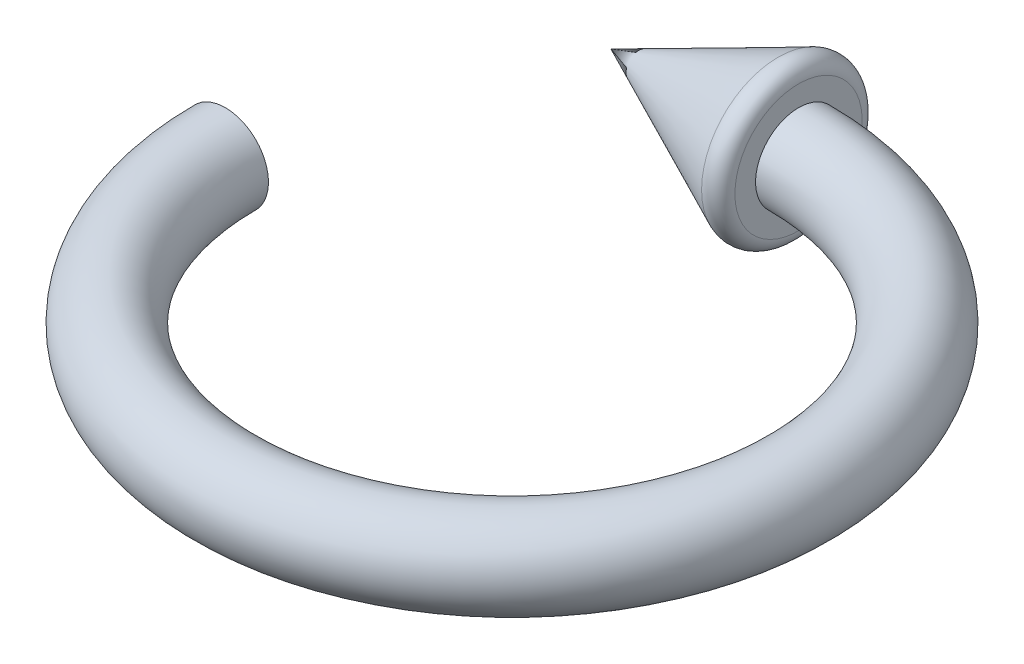
ISO-10303-21;
HEADER;
FILE_DESCRIPTION(('STEP AP214'),'2;1');
FILE_NAME('part.step','',(''),(''),'','','');
FILE_SCHEMA(('AUTOMOTIVE_DESIGN { 1 0 10303 214 1 1 1 1 }'));
ENDSEC;
DATA;
#1=APPLICATION_CONTEXT('core data for automotive mechanical design processes');
#2=APPLICATION_PROTOCOL_DEFINITION('international standard','automotive_design',2000,#1);
#3=PRODUCT_CONTEXT('',#1,'mechanical');
#4=PRODUCT('Part','Part','',(#3));
#5=PRODUCT_RELATED_PRODUCT_CATEGORY('part','',(#4));
#6=PRODUCT_DEFINITION_FORMATION('','',#4);
#7=PRODUCT_DEFINITION_CONTEXT('part definition',#1,'design');
#8=PRODUCT_DEFINITION('design','',#6,#7);
#9=PRODUCT_DEFINITION_SHAPE('','',#8);
#10=(LENGTH_UNIT() NAMED_UNIT(*) SI_UNIT(.MILLI.,.METRE.));
#11=(NAMED_UNIT(*) PLANE_ANGLE_UNIT() SI_UNIT($,.RADIAN.));
#12=(NAMED_UNIT(*) SI_UNIT($,.STERADIAN.) SOLID_ANGLE_UNIT());
#13=UNCERTAINTY_MEASURE_WITH_UNIT(LENGTH_MEASURE(1.E-05),#10,'distance_accuracy_value','');
#14=(GEOMETRIC_REPRESENTATION_CONTEXT(3) GLOBAL_UNCERTAINTY_ASSIGNED_CONTEXT((#13)) GLOBAL_UNIT_ASSIGNED_CONTEXT((#10,
#11,#12)) REPRESENTATION_CONTEXT('',''));
#15=CARTESIAN_POINT('',(0.,0.,0.));
#16=DIRECTION('',(0.,0.,1.));
#17=DIRECTION('',(1.,0.,0.));
#18=AXIS2_PLACEMENT_3D('',#15,#16,#17);
#19=CARTESIAN_POINT('',(0.,0.,0.));
#20=DIRECTION('',(0.,-1.,0.));
#21=DIRECTION('',(0.,0.,-1.));
#22=AXIS2_PLACEMENT_3D('',#19,#20,#21);
#23=TOROIDAL_SURFACE('',#22,200.,30.);
#24=CARTESIAN_POINT('',(-2.80543275242573E-12,0.,-200.));
#25=DIRECTION('',(-1.,0.,0.));
#26=DIRECTION('',(0.,0.,1.));
#27=AXIS2_PLACEMENT_3D('',#24,#25,#26);
#28=CIRCLE('',#27,30.);
#29=CARTESIAN_POINT('',(-3.22624766528959E-12,0.,-230.));
#30=VERTEX_POINT('',#29);
#31=EDGE_CURVE('E65',#30,#30,#28,.T.);
#32=CARTESIAN_POINT('',(-200.,0.,0.));
#33=DIRECTION('',(0.,0.,1.));
#34=DIRECTION('',(1.,0.,0.));
#35=AXIS2_PLACEMENT_3D('',#32,#33,#34);
#36=CIRCLE('',#35,30.);
#37=CARTESIAN_POINT('',(-230.,0.,0.));
#38=VERTEX_POINT('',#37);
#39=EDGE_CURVE('E68',#38,#38,#36,.T.);
#40=CARTESIAN_POINT('',(0.,0.,0.));
#41=DIRECTION('',(0.,-1.,0.));
#42=DIRECTION('',(0.,0.,-1.));
#43=AXIS2_PLACEMENT_3D('',#40,#41,#42);
#44=CIRCLE('',#43,230.);
#45=EDGE_CURVE('',#30,#38,#44,.T.);
#46=ORIENTED_EDGE('',*,*,#31,.F.);
#47=ORIENTED_EDGE('',*,*,#39,.T.);
#48=ORIENTED_EDGE('',*,*,#45,.T.);
#49=ORIENTED_EDGE('',*,*,#45,.F.);
#50=EDGE_LOOP('',(#46,#48,#47,#49));
#51=FACE_BOUND('',#50,.T.);
#52=ADVANCED_FACE('F31',(#51),#23,.T.);
#53=CARTESIAN_POINT('',(-200.,0.,0.));
#54=DIRECTION('',(0.,0.,1.));
#55=DIRECTION('',(1.,0.,0.));
#56=AXIS2_PLACEMENT_3D('',#53,#54,#55);
#57=PLANE('',#56);
#58=ORIENTED_EDGE('',*,*,#39,.F.);
#59=EDGE_LOOP('',(#58));
#60=FACE_BOUND('',#59,.T.);
#61=ADVANCED_FACE('F51',(#60),#57,.F.);
#62=CARTESIAN_POINT('',(0.,0.,-200.));
#63=DIRECTION('',(-1.,0.,0.));
#64=DIRECTION('',(0.,0.,1.));
#65=AXIS2_PLACEMENT_3D('',#62,#63,#64);
#66=PLANE('',#65);
#67=CARTESIAN_POINT('',(0.,0.,-200.));
#68=DIRECTION('',(-1.,0.,0.));
#69=DIRECTION('',(0.,0.,1.));
#70=AXIS2_PLACEMENT_3D('',#67,#68,#69);
#71=CIRCLE('',#70,44.4193415805561);
#72=CARTESIAN_POINT('',(0.,0.,-155.580658419444));
#73=VERTEX_POINT('',#72);
#74=EDGE_CURVE('E11',#73,#73,#71,.F.);
#75=ORIENTED_EDGE('',*,*,#74,.T.);
#76=EDGE_LOOP('',(#75));
#77=FACE_BOUND('',#76,.T.);
#78=ORIENTED_EDGE('',*,*,#31,.T.);
#79=EDGE_LOOP('',(#78));
#80=FACE_BOUND('',#79,.T.);
#81=ADVANCED_FACE('F43',(#77,#80),#66,.F.);
#82=CARTESIAN_POINT('',(0.,0.,-200.));
#83=DIRECTION('',(1.,0.,0.));
#84=DIRECTION('',(0.,0.,-1.));
#85=AXIS2_PLACEMENT_3D('',#82,#83,#84);
#86=CONICAL_SURFACE('',#85,60.,0.42958780212572);
#87=CARTESIAN_POINT('',(-14.1649609327536,0.,-200.));
#88=DIRECTION('',(-1.,0.,0.));
#89=DIRECTION('',(0.,0.,1.));
#90=AXIS2_PLACEMENT_3D('',#87,#88,#89);
#91=CIRCLE('',#90,53.5107166376437);
#92=CARTESIAN_POINT('',(-14.1649609327536,0.,-146.489283362356));
#93=VERTEX_POINT('',#92);
#94=EDGE_CURVE('E38',#93,#93,#91,.T.);
#95=ORIENTED_EDGE('',*,*,#94,.T.);
#96=EDGE_LOOP('',(#95));
#97=FACE_BOUND('',#96,.T.);
#98=CARTESIAN_POINT('',(-130.969416576166,0.,-200.));
#99=VERTEX_POINT('',#98);
#100=VERTEX_LOOP('',#99);
#101=FACE_BOUND('',#100,.T.);
#102=ADVANCED_FACE('F41',(#97,#101),#86,.T.);
#103=CARTESIAN_POINT('',(-10.,0.,-200.));
#104=DIRECTION('',(-1.,0.,0.));
#105=DIRECTION('',(0.,0.,1.));
#106=AXIS2_PLACEMENT_3D('',#103,#104,#105);
#107=TOROIDAL_SURFACE('',#106,44.4193415805561,10.);
#108=ORIENTED_EDGE('',*,*,#74,.F.);
#109=EDGE_LOOP('',(#108));
#110=FACE_BOUND('',#109,.T.);
#111=ORIENTED_EDGE('',*,*,#94,.F.);
#112=EDGE_LOOP('',(#111));
#113=FACE_BOUND('',#112,.T.);
#114=ADVANCED_FACE('F33',(#110,#113),#107,.T.);
#115=CLOSED_SHELL('',(#52,#61,#81,#102,#114));
#116=MANIFOLD_SOLID_BREP('B2',#115);
#117=ADVANCED_BREP_SHAPE_REPRESENTATION('',(#18,#116),#14);
#118=SHAPE_DEFINITION_REPRESENTATION(#9,#117);
ENDSEC;
END-ISO-10303-21;
